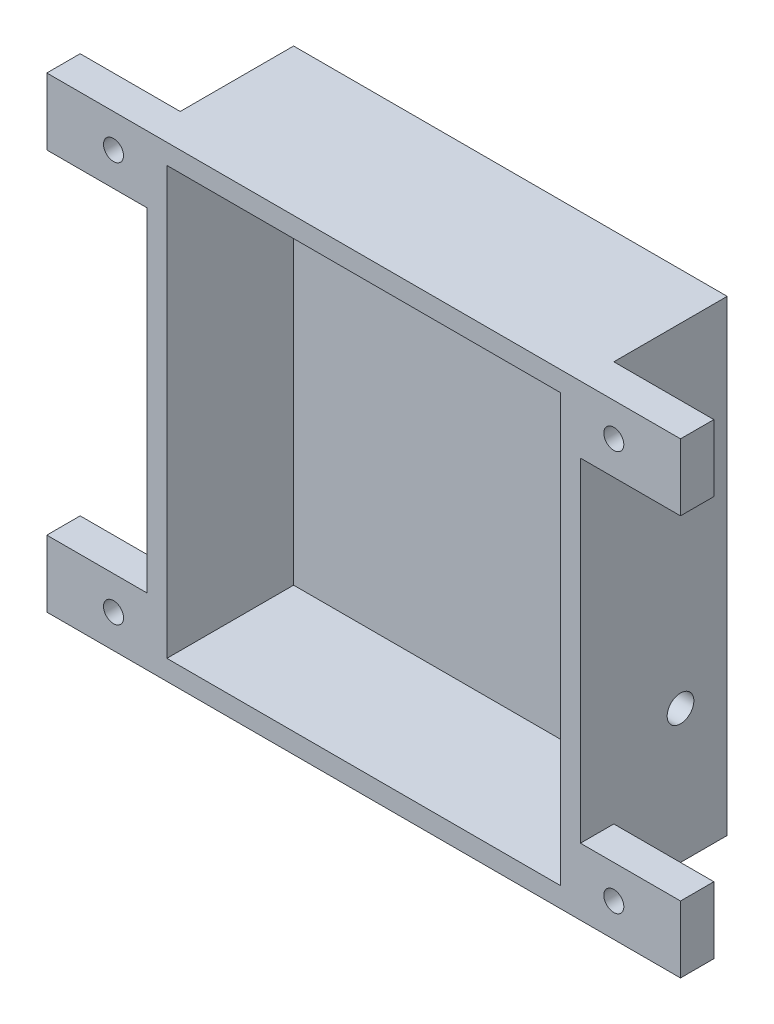
ISO-10303-21;
HEADER;
FILE_DESCRIPTION(('STEP AP214'),'2;1');
FILE_NAME('part.step','',(''),(''),'','','');
FILE_SCHEMA(('AUTOMOTIVE_DESIGN { 1 0 10303 214 1 1 1 1 }'));
ENDSEC;
DATA;
#1=APPLICATION_CONTEXT('core data for automotive mechanical design processes');
#2=APPLICATION_PROTOCOL_DEFINITION('international standard','automotive_design',2000,#1);
#3=PRODUCT_CONTEXT('',#1,'mechanical');
#4=PRODUCT('Part','Part','',(#3));
#5=PRODUCT_RELATED_PRODUCT_CATEGORY('part','',(#4));
#6=PRODUCT_DEFINITION_FORMATION('','',#4);
#7=PRODUCT_DEFINITION_CONTEXT('part definition',#1,'design');
#8=PRODUCT_DEFINITION('design','',#6,#7);
#9=PRODUCT_DEFINITION_SHAPE('','',#8);
#10=(LENGTH_UNIT() NAMED_UNIT(*) SI_UNIT(.MILLI.,.METRE.));
#11=(NAMED_UNIT(*) PLANE_ANGLE_UNIT() SI_UNIT($,.RADIAN.));
#12=(NAMED_UNIT(*) SI_UNIT($,.STERADIAN.) SOLID_ANGLE_UNIT());
#13=UNCERTAINTY_MEASURE_WITH_UNIT(LENGTH_MEASURE(1.E-05),#10,'distance_accuracy_value','');
#14=(GEOMETRIC_REPRESENTATION_CONTEXT(3) GLOBAL_UNCERTAINTY_ASSIGNED_CONTEXT((#13)) GLOBAL_UNIT_ASSIGNED_CONTEXT((#10,
#11,#12)) REPRESENTATION_CONTEXT('',''));
#15=CARTESIAN_POINT('',(0.,0.,0.));
#16=DIRECTION('',(0.,0.,1.));
#17=DIRECTION('',(1.,0.,0.));
#18=AXIS2_PLACEMENT_3D('',#15,#16,#17);
#19=CARTESIAN_POINT('',(-3.,0.,19.));
#20=DIRECTION('',(1.,0.,0.));
#21=DIRECTION('',(0.,0.,-1.));
#22=AXIS2_PLACEMENT_3D('',#19,#20,#21);
#23=PLANE('',#22);
#24=DIRECTION('',(0.,-1.,0.));
#25=VECTOR('',#24,1.);
#26=CARTESIAN_POINT('',(-3.,67.,14.));
#27=LINE('',#26,#25);
#28=CARTESIAN_POINT('',(-3.,67.,14.));
#29=VERTEX_POINT('',#28);
#30=CARTESIAN_POINT('',(-3.,57.,14.));
#31=VERTEX_POINT('',#30);
#32=EDGE_CURVE('E202',#29,#31,#27,.T.);
#33=ORIENTED_EDGE('',*,*,#32,.F.);
#34=DIRECTION('',(0.,0.,-1.));
#35=VECTOR('',#34,1.);
#36=CARTESIAN_POINT('',(-3.,67.,19.));
#37=LINE('',#36,#35);
#38=CARTESIAN_POINT('',(-3.,67.,-3.));
#39=VERTEX_POINT('',#38);
#40=EDGE_CURVE('E185',#29,#39,#37,.T.);
#41=ORIENTED_EDGE('',*,*,#40,.T.);
#42=DIRECTION('',(0.,-1.,0.));
#43=VECTOR('',#42,1.);
#44=CARTESIAN_POINT('',(-3.,0.,-3.));
#45=LINE('',#44,#43);
#46=CARTESIAN_POINT('',(-3.,-3.,-3.));
#47=VERTEX_POINT('',#46);
#48=EDGE_CURVE('E321',#39,#47,#45,.T.);
#49=ORIENTED_EDGE('',*,*,#48,.T.);
#50=DIRECTION('',(0.,0.,-1.));
#51=VECTOR('',#50,1.);
#52=CARTESIAN_POINT('',(-3.,-3.,19.));
#53=LINE('',#52,#51);
#54=CARTESIAN_POINT('',(-3.,-3.,14.));
#55=VERTEX_POINT('',#54);
#56=EDGE_CURVE('E11',#55,#47,#53,.T.);
#57=ORIENTED_EDGE('',*,*,#56,.F.);
#58=DIRECTION('',(0.,-1.,0.));
#59=VECTOR('',#58,1.);
#60=CARTESIAN_POINT('',(-3.,-3.,14.));
#61=LINE('',#60,#59);
#62=CARTESIAN_POINT('',(-3.,7.,14.));
#63=VERTEX_POINT('',#62);
#64=EDGE_CURVE('E222',#63,#55,#61,.T.);
#65=ORIENTED_EDGE('',*,*,#64,.F.);
#66=DIRECTION('',(0.,0.,-1.));
#67=VECTOR('',#66,1.);
#68=CARTESIAN_POINT('',(-3.,7.,19.));
#69=LINE('',#68,#67);
#70=CARTESIAN_POINT('',(-3.,7.,19.));
#71=VERTEX_POINT('',#70);
#72=EDGE_CURVE('E217',#71,#63,#69,.T.);
#73=ORIENTED_EDGE('',*,*,#72,.F.);
#74=DIRECTION('',(0.,-1.,0.));
#75=VECTOR('',#74,1.);
#76=CARTESIAN_POINT('',(-3.,0.,19.));
#77=LINE('',#76,#75);
#78=CARTESIAN_POINT('',(-3.,57.,19.));
#79=VERTEX_POINT('',#78);
#80=EDGE_CURVE('E57',#79,#71,#77,.T.);
#81=ORIENTED_EDGE('',*,*,#80,.F.);
#82=DIRECTION('',(0.,0.,1.));
#83=VECTOR('',#82,1.);
#84=CARTESIAN_POINT('',(-3.,57.,19.));
#85=LINE('',#84,#83);
#86=EDGE_CURVE('E52',#31,#79,#85,.T.);
#87=ORIENTED_EDGE('',*,*,#86,.F.);
#88=EDGE_LOOP('',(#33,#41,#49,#57,#65,#73,#81,#87));
#89=FACE_BOUND('',#88,.T.);
#90=ADVANCED_FACE('F35',(#89),#23,.F.);
#91=CARTESIAN_POINT('',(62.,0.,19.));
#92=DIRECTION('',(-1.,0.,0.));
#93=DIRECTION('',(0.,0.,1.));
#94=AXIS2_PLACEMENT_3D('',#91,#92,#93);
#95=PLANE('',#94);
#96=CARTESIAN_POINT('',(62.,17.,4.));
#97=DIRECTION('',(1.,0.,0.));
#98=DIRECTION('',(0.,0.,-1.));
#99=AXIS2_PLACEMENT_3D('',#96,#97,#98);
#100=CIRCLE('',#99,2.);
#101=CARTESIAN_POINT('',(62.,17.,2.));
#102=VERTEX_POINT('',#101);
#103=EDGE_CURVE('E288',#102,#102,#100,.T.);
#104=ORIENTED_EDGE('',*,*,#103,.F.);
#105=EDGE_LOOP('',(#104));
#106=FACE_BOUND('',#105,.T.);
#107=DIRECTION('',(0.,1.,0.));
#108=VECTOR('',#107,1.);
#109=CARTESIAN_POINT('',(62.,-3.,14.));
#110=LINE('',#109,#108);
#111=CARTESIAN_POINT('',(62.,-3.,14.));
#112=VERTEX_POINT('',#111);
#113=CARTESIAN_POINT('',(62.,7.,14.));
#114=VERTEX_POINT('',#113);
#115=EDGE_CURVE('E242',#112,#114,#110,.T.);
#116=ORIENTED_EDGE('',*,*,#115,.F.);
#117=DIRECTION('',(0.,0.,-1.));
#118=VECTOR('',#117,1.);
#119=CARTESIAN_POINT('',(62.,-3.,19.));
#120=LINE('',#119,#118);
#121=CARTESIAN_POINT('',(62.,-3.,-3.));
#122=VERTEX_POINT('',#121);
#123=EDGE_CURVE('E44',#112,#122,#120,.T.);
#124=ORIENTED_EDGE('',*,*,#123,.T.);
#125=DIRECTION('',(0.,1.,0.));
#126=VECTOR('',#125,1.);
#127=CARTESIAN_POINT('',(62.,0.,-3.));
#128=LINE('',#127,#126);
#129=CARTESIAN_POINT('',(62.,67.,-3.));
#130=VERTEX_POINT('',#129);
#131=EDGE_CURVE('E329',#122,#130,#128,.T.);
#132=ORIENTED_EDGE('',*,*,#131,.T.);
#133=DIRECTION('',(0.,0.,-1.));
#134=VECTOR('',#133,1.);
#135=CARTESIAN_POINT('',(62.,67.,19.));
#136=LINE('',#135,#134);
#137=CARTESIAN_POINT('',(62.,67.,14.));
#138=VERTEX_POINT('',#137);
#139=EDGE_CURVE('E326',#138,#130,#136,.T.);
#140=ORIENTED_EDGE('',*,*,#139,.F.);
#141=DIRECTION('',(0.,1.,0.));
#142=VECTOR('',#141,1.);
#143=CARTESIAN_POINT('',(62.,67.,14.));
#144=LINE('',#143,#142);
#145=CARTESIAN_POINT('',(62.,57.,14.));
#146=VERTEX_POINT('',#145);
#147=EDGE_CURVE('E269',#146,#138,#144,.T.);
#148=ORIENTED_EDGE('',*,*,#147,.F.);
#149=DIRECTION('',(0.,0.,-1.));
#150=VECTOR('',#149,1.);
#151=CARTESIAN_POINT('',(62.,57.,19.));
#152=LINE('',#151,#150);
#153=CARTESIAN_POINT('',(62.,57.,19.));
#154=VERTEX_POINT('',#153);
#155=EDGE_CURVE('E266',#154,#146,#152,.T.);
#156=ORIENTED_EDGE('',*,*,#155,.F.);
#157=DIRECTION('',(0.,1.,0.));
#158=VECTOR('',#157,1.);
#159=CARTESIAN_POINT('',(62.,0.,19.));
#160=LINE('',#159,#158);
#161=CARTESIAN_POINT('',(62.,7.,19.));
#162=VERTEX_POINT('',#161);
#163=EDGE_CURVE('E186',#162,#154,#160,.T.);
#164=ORIENTED_EDGE('',*,*,#163,.F.);
#165=DIRECTION('',(0.,0.,1.));
#166=VECTOR('',#165,1.);
#167=CARTESIAN_POINT('',(62.,7.,19.));
#168=LINE('',#167,#166);
#169=EDGE_CURVE('E247',#114,#162,#168,.T.);
#170=ORIENTED_EDGE('',*,*,#169,.F.);
#171=EDGE_LOOP('',(#116,#124,#132,#140,#148,#156,#164,#170));
#172=FACE_BOUND('',#171,.T.);
#173=ADVANCED_FACE('F344',(#106,#172),#95,.F.);
#174=CARTESIAN_POINT('',(0.,0.,19.));
#175=DIRECTION('',(0.,0.,-1.));
#176=DIRECTION('',(-1.,0.,0.));
#177=AXIS2_PLACEMENT_3D('',#174,#175,#176);
#178=PLANE('',#177);
#179=CARTESIAN_POINT('',(-8.00000000000001,62.,19.));
#180=DIRECTION('',(0.,0.,-1.));
#181=DIRECTION('',(-1.,0.,0.));
#182=AXIS2_PLACEMENT_3D('',#179,#180,#181);
#183=CIRCLE('',#182,1.5);
#184=CARTESIAN_POINT('',(-9.50000000000001,62.,19.));
#185=VERTEX_POINT('',#184);
#186=EDGE_CURVE('E470',#185,#185,#183,.T.);
#187=ORIENTED_EDGE('',*,*,#186,.T.);
#188=EDGE_LOOP('',(#187));
#189=FACE_BOUND('',#188,.T.);
#190=CARTESIAN_POINT('',(67.,2.,19.));
#191=DIRECTION('',(0.,0.,-1.));
#192=DIRECTION('',(-1.,0.,0.));
#193=AXIS2_PLACEMENT_3D('',#190,#191,#192);
#194=CIRCLE('',#193,1.5);
#195=CARTESIAN_POINT('',(65.5,2.,19.));
#196=VERTEX_POINT('',#195);
#197=EDGE_CURVE('E469',#196,#196,#194,.T.);
#198=ORIENTED_EDGE('',*,*,#197,.T.);
#199=EDGE_LOOP('',(#198));
#200=FACE_BOUND('',#199,.T.);
#201=CARTESIAN_POINT('',(-8.,2.,19.));
#202=DIRECTION('',(0.,0.,-1.));
#203=DIRECTION('',(-1.,0.,0.));
#204=AXIS2_PLACEMENT_3D('',#201,#202,#203);
#205=CIRCLE('',#204,1.5);
#206=CARTESIAN_POINT('',(-9.5,2.,19.));
#207=VERTEX_POINT('',#206);
#208=EDGE_CURVE('E467',#207,#207,#205,.T.);
#209=ORIENTED_EDGE('',*,*,#208,.T.);
#210=EDGE_LOOP('',(#209));
#211=FACE_BOUND('',#210,.T.);
#212=CARTESIAN_POINT('',(67.,62.,19.));
#213=DIRECTION('',(0.,0.,-1.));
#214=DIRECTION('',(-1.,0.,0.));
#215=AXIS2_PLACEMENT_3D('',#212,#213,#214);
#216=CIRCLE('',#215,1.5);
#217=CARTESIAN_POINT('',(65.5,62.,19.));
#218=VERTEX_POINT('',#217);
#219=EDGE_CURVE('E205',#218,#218,#216,.T.);
#220=ORIENTED_EDGE('',*,*,#219,.T.);
#221=EDGE_LOOP('',(#220));
#222=FACE_BOUND('',#221,.T.);
#223=DIRECTION('',(-1.,0.,0.));
#224=VECTOR('',#223,1.);
#225=CARTESIAN_POINT('',(0.,67.,19.));
#226=LINE('',#225,#224);
#227=CARTESIAN_POINT('',(77.,67.,19.));
#228=VERTEX_POINT('',#227);
#229=CARTESIAN_POINT('',(-18.,67.,19.));
#230=VERTEX_POINT('',#229);
#231=EDGE_CURVE('E172',#228,#230,#226,.T.);
#232=ORIENTED_EDGE('',*,*,#231,.T.);
#233=DIRECTION('',(0.,1.,0.));
#234=VECTOR('',#233,1.);
#235=CARTESIAN_POINT('',(-18.,67.,19.));
#236=LINE('',#235,#234);
#237=CARTESIAN_POINT('',(-18.,57.,19.));
#238=VERTEX_POINT('',#237);
#239=EDGE_CURVE('E178',#238,#230,#236,.T.);
#240=ORIENTED_EDGE('',*,*,#239,.F.);
#241=DIRECTION('',(1.,0.,0.));
#242=VECTOR('',#241,1.);
#243=CARTESIAN_POINT('',(-18.,57.,19.));
#244=LINE('',#243,#242);
#245=EDGE_CURVE('E210',#238,#79,#244,.T.);
#246=ORIENTED_EDGE('',*,*,#245,.T.);
#247=ORIENTED_EDGE('',*,*,#80,.T.);
#248=DIRECTION('',(1.,0.,0.));
#249=VECTOR('',#248,1.);
#250=CARTESIAN_POINT('',(-18.,7.,19.));
#251=LINE('',#250,#249);
#252=CARTESIAN_POINT('',(-18.,7.,19.));
#253=VERTEX_POINT('',#252);
#254=EDGE_CURVE('E239',#253,#71,#251,.T.);
#255=ORIENTED_EDGE('',*,*,#254,.F.);
#256=DIRECTION('',(0.,1.,0.));
#257=VECTOR('',#256,1.);
#258=CARTESIAN_POINT('',(-18.,-3.,19.));
#259=LINE('',#258,#257);
#260=CARTESIAN_POINT('',(-18.,-3.,19.));
#261=VERTEX_POINT('',#260);
#262=EDGE_CURVE('E218',#261,#253,#259,.T.);
#263=ORIENTED_EDGE('',*,*,#262,.F.);
#264=DIRECTION('',(1.,0.,0.));
#265=VECTOR('',#264,1.);
#266=CARTESIAN_POINT('',(0.,-3.,19.));
#267=LINE('',#266,#265);
#268=CARTESIAN_POINT('',(77.,-3.,19.));
#269=VERTEX_POINT('',#268);
#270=EDGE_CURVE('E337',#261,#269,#267,.T.);
#271=ORIENTED_EDGE('',*,*,#270,.T.);
#272=DIRECTION('',(0.,-1.,0.));
#273=VECTOR('',#272,1.);
#274=CARTESIAN_POINT('',(77.,-3.,19.));
#275=LINE('',#274,#273);
#276=CARTESIAN_POINT('',(77.,7.,19.));
#277=VERTEX_POINT('',#276);
#278=EDGE_CURVE('E243',#277,#269,#275,.T.);
#279=ORIENTED_EDGE('',*,*,#278,.F.);
#280=DIRECTION('',(-1.,0.,0.));
#281=VECTOR('',#280,1.);
#282=CARTESIAN_POINT('',(77.,7.,19.));
#283=LINE('',#282,#281);
#284=EDGE_CURVE('E253',#277,#162,#283,.T.);
#285=ORIENTED_EDGE('',*,*,#284,.T.);
#286=ORIENTED_EDGE('',*,*,#163,.T.);
#287=DIRECTION('',(-1.,0.,0.));
#288=VECTOR('',#287,1.);
#289=CARTESIAN_POINT('',(77.,57.,19.));
#290=LINE('',#289,#288);
#291=CARTESIAN_POINT('',(77.,57.,19.));
#292=VERTEX_POINT('',#291);
#293=EDGE_CURVE('E285',#292,#154,#290,.T.);
#294=ORIENTED_EDGE('',*,*,#293,.F.);
#295=DIRECTION('',(0.,-1.,0.));
#296=VECTOR('',#295,1.);
#297=CARTESIAN_POINT('',(77.,67.,19.));
#298=LINE('',#297,#296);
#299=EDGE_CURVE('E181',#228,#292,#298,.T.);
#300=ORIENTED_EDGE('',*,*,#299,.F.);
#301=EDGE_LOOP('',(#232,#240,#246,#247,#255,#263,#271,#279,#285,#286,#294,#300));
#302=FACE_BOUND('',#301,.T.);
#303=DIRECTION('',(0.,-1.,0.));
#304=VECTOR('',#303,1.);
#305=CARTESIAN_POINT('',(0.,0.,19.));
#306=LINE('',#305,#304);
#307=CARTESIAN_POINT('',(0.,64.,19.));
#308=VERTEX_POINT('',#307);
#309=CARTESIAN_POINT('',(0.,0.,19.));
#310=VERTEX_POINT('',#309);
#311=EDGE_CURVE('E291',#308,#310,#306,.T.);
#312=ORIENTED_EDGE('',*,*,#311,.F.);
#313=DIRECTION('',(-1.,0.,0.));
#314=VECTOR('',#313,1.);
#315=CARTESIAN_POINT('',(0.,64.,19.));
#316=LINE('',#315,#314);
#317=CARTESIAN_POINT('',(59.,64.,19.));
#318=VERTEX_POINT('',#317);
#319=EDGE_CURVE('E299',#318,#308,#316,.T.);
#320=ORIENTED_EDGE('',*,*,#319,.F.);
#321=DIRECTION('',(0.,1.,0.));
#322=VECTOR('',#321,1.);
#323=CARTESIAN_POINT('',(59.,0.,19.));
#324=LINE('',#323,#322);
#325=CARTESIAN_POINT('',(59.,0.,19.));
#326=VERTEX_POINT('',#325);
#327=EDGE_CURVE('E296',#326,#318,#324,.T.);
#328=ORIENTED_EDGE('',*,*,#327,.F.);
#329=DIRECTION('',(1.,0.,0.));
#330=VECTOR('',#329,1.);
#331=CARTESIAN_POINT('',(0.,0.,19.));
#332=LINE('',#331,#330);
#333=EDGE_CURVE('E293',#310,#326,#332,.T.);
#334=ORIENTED_EDGE('',*,*,#333,.F.);
#335=EDGE_LOOP('',(#312,#320,#328,#334));
#336=FACE_BOUND('',#335,.T.);
#337=ADVANCED_FACE('F174',(#189,#200,#211,#222,#302,#336),#178,.F.);
#338=CARTESIAN_POINT('',(0.,-3.,19.));
#339=DIRECTION('',(0.,1.,0.));
#340=DIRECTION('',(0.,0.,1.));
#341=AXIS2_PLACEMENT_3D('',#338,#339,#340);
#342=PLANE('',#341);
#343=DIRECTION('',(1.,0.,0.));
#344=VECTOR('',#343,1.);
#345=CARTESIAN_POINT('',(0.,-3.,-3.));
#346=LINE('',#345,#344);
#347=EDGE_CURVE('E323',#47,#122,#346,.T.);
#348=ORIENTED_EDGE('',*,*,#347,.T.);
#349=ORIENTED_EDGE('',*,*,#123,.F.);
#350=DIRECTION('',(-1.,0.,0.));
#351=VECTOR('',#350,1.);
#352=CARTESIAN_POINT('',(77.,-3.,14.));
#353=LINE('',#352,#351);
#354=CARTESIAN_POINT('',(77.,-3.,14.));
#355=VERTEX_POINT('',#354);
#356=EDGE_CURVE('E263',#355,#112,#353,.T.);
#357=ORIENTED_EDGE('',*,*,#356,.F.);
#358=DIRECTION('',(0.,0.,-1.));
#359=VECTOR('',#358,1.);
#360=CARTESIAN_POINT('',(77.,-3.,19.));
#361=LINE('',#360,#359);
#362=EDGE_CURVE('E246',#269,#355,#361,.T.);
#363=ORIENTED_EDGE('',*,*,#362,.F.);
#364=ORIENTED_EDGE('',*,*,#270,.F.);
#365=DIRECTION('',(0.,0.,1.));
#366=VECTOR('',#365,1.);
#367=CARTESIAN_POINT('',(-18.,-3.,19.));
#368=LINE('',#367,#366);
#369=CARTESIAN_POINT('',(-18.,-3.,14.));
#370=VERTEX_POINT('',#369);
#371=EDGE_CURVE('E226',#370,#261,#368,.T.);
#372=ORIENTED_EDGE('',*,*,#371,.F.);
#373=DIRECTION('',(1.,0.,0.));
#374=VECTOR('',#373,1.);
#375=CARTESIAN_POINT('',(-18.,-3.,14.));
#376=LINE('',#375,#374);
#377=EDGE_CURVE('E229',#370,#55,#376,.T.);
#378=ORIENTED_EDGE('',*,*,#377,.T.);
#379=ORIENTED_EDGE('',*,*,#56,.T.);
#380=EDGE_LOOP('',(#348,#349,#357,#363,#364,#372,#378,#379));
#381=FACE_BOUND('',#380,.T.);
#382=ADVANCED_FACE('F376',(#381),#342,.F.);
#383=CARTESIAN_POINT('',(0.,67.,19.));
#384=DIRECTION('',(0.,-1.,0.));
#385=DIRECTION('',(0.,0.,-1.));
#386=AXIS2_PLACEMENT_3D('',#383,#384,#385);
#387=PLANE('',#386);
#388=DIRECTION('',(-1.,0.,0.));
#389=VECTOR('',#388,1.);
#390=CARTESIAN_POINT('',(0.,67.,-3.));
#391=LINE('',#390,#389);
#392=EDGE_CURVE('E333',#130,#39,#391,.T.);
#393=ORIENTED_EDGE('',*,*,#392,.T.);
#394=ORIENTED_EDGE('',*,*,#40,.F.);
#395=DIRECTION('',(1.,0.,0.));
#396=VECTOR('',#395,1.);
#397=CARTESIAN_POINT('',(-18.,67.,14.));
#398=LINE('',#397,#396);
#399=CARTESIAN_POINT('',(-18.,67.,14.));
#400=VERTEX_POINT('',#399);
#401=EDGE_CURVE('E192',#400,#29,#398,.T.);
#402=ORIENTED_EDGE('',*,*,#401,.F.);
#403=DIRECTION('',(0.,0.,-1.));
#404=VECTOR('',#403,1.);
#405=CARTESIAN_POINT('',(-18.,67.,19.));
#406=LINE('',#405,#404);
#407=EDGE_CURVE('E188',#230,#400,#406,.T.);
#408=ORIENTED_EDGE('',*,*,#407,.F.);
#409=ORIENTED_EDGE('',*,*,#231,.F.);
#410=DIRECTION('',(0.,0.,1.));
#411=VECTOR('',#410,1.);
#412=CARTESIAN_POINT('',(77.,67.,19.));
#413=LINE('',#412,#411);
#414=CARTESIAN_POINT('',(77.,67.,14.));
#415=VERTEX_POINT('',#414);
#416=EDGE_CURVE('E273',#415,#228,#413,.T.);
#417=ORIENTED_EDGE('',*,*,#416,.F.);
#418=DIRECTION('',(-1.,0.,0.));
#419=VECTOR('',#418,1.);
#420=CARTESIAN_POINT('',(77.,67.,14.));
#421=LINE('',#420,#419);
#422=EDGE_CURVE('E275',#415,#138,#421,.T.);
#423=ORIENTED_EDGE('',*,*,#422,.T.);
#424=ORIENTED_EDGE('',*,*,#139,.T.);
#425=EDGE_LOOP('',(#393,#394,#402,#408,#409,#417,#423,#424));
#426=FACE_BOUND('',#425,.T.);
#427=ADVANCED_FACE('F190',(#426),#387,.F.);
#428=CARTESIAN_POINT('',(0.,0.,-3.));
#429=DIRECTION('',(0.,0.,-1.));
#430=DIRECTION('',(-1.,0.,0.));
#431=AXIS2_PLACEMENT_3D('',#428,#429,#430);
#432=PLANE('',#431);
#433=ORIENTED_EDGE('',*,*,#48,.F.);
#434=ORIENTED_EDGE('',*,*,#392,.F.);
#435=ORIENTED_EDGE('',*,*,#131,.F.);
#436=ORIENTED_EDGE('',*,*,#347,.F.);
#437=EDGE_LOOP('',(#433,#434,#435,#436));
#438=FACE_BOUND('',#437,.T.);
#439=ADVANCED_FACE('F37',(#438),#432,.T.);
#440=CARTESIAN_POINT('',(0.,0.,19.));
#441=DIRECTION('',(1.,0.,0.));
#442=DIRECTION('',(0.,0.,-1.));
#443=AXIS2_PLACEMENT_3D('',#440,#441,#442);
#444=PLANE('',#443);
#445=DIRECTION('',(0.,-1.,0.));
#446=VECTOR('',#445,1.);
#447=CARTESIAN_POINT('',(0.,0.,0.));
#448=LINE('',#447,#446);
#449=CARTESIAN_POINT('',(0.,64.,0.));
#450=VERTEX_POINT('',#449);
#451=CARTESIAN_POINT('',(0.,0.,0.));
#452=VERTEX_POINT('',#451);
#453=EDGE_CURVE('E302',#450,#452,#448,.T.);
#454=ORIENTED_EDGE('',*,*,#453,.F.);
#455=DIRECTION('',(0.,0.,-1.));
#456=VECTOR('',#455,1.);
#457=CARTESIAN_POINT('',(0.,64.,19.));
#458=LINE('',#457,#456);
#459=EDGE_CURVE('E301',#308,#450,#458,.T.);
#460=ORIENTED_EDGE('',*,*,#459,.F.);
#461=ORIENTED_EDGE('',*,*,#311,.T.);
#462=DIRECTION('',(0.,0.,-1.));
#463=VECTOR('',#462,1.);
#464=CARTESIAN_POINT('',(0.,0.,19.));
#465=LINE('',#464,#463);
#466=EDGE_CURVE('E318',#310,#452,#465,.T.);
#467=ORIENTED_EDGE('',*,*,#466,.T.);
#468=EDGE_LOOP('',(#454,#460,#461,#467));
#469=FACE_BOUND('',#468,.T.);
#470=ADVANCED_FACE('F383',(#469),#444,.T.);
#471=CARTESIAN_POINT('',(0.,0.,19.));
#472=DIRECTION('',(0.,1.,0.));
#473=DIRECTION('',(0.,0.,1.));
#474=AXIS2_PLACEMENT_3D('',#471,#472,#473);
#475=PLANE('',#474);
#476=DIRECTION('',(1.,0.,0.));
#477=VECTOR('',#476,1.);
#478=CARTESIAN_POINT('',(0.,0.,0.));
#479=LINE('',#478,#477);
#480=CARTESIAN_POINT('',(59.,0.,0.));
#481=VERTEX_POINT('',#480);
#482=EDGE_CURVE('E305',#452,#481,#479,.T.);
#483=ORIENTED_EDGE('',*,*,#482,.F.);
#484=ORIENTED_EDGE('',*,*,#466,.F.);
#485=ORIENTED_EDGE('',*,*,#333,.T.);
#486=DIRECTION('',(0.,0.,-1.));
#487=VECTOR('',#486,1.);
#488=CARTESIAN_POINT('',(59.,0.,19.));
#489=LINE('',#488,#487);
#490=EDGE_CURVE('E315',#326,#481,#489,.T.);
#491=ORIENTED_EDGE('',*,*,#490,.T.);
#492=EDGE_LOOP('',(#483,#484,#485,#491));
#493=FACE_BOUND('',#492,.T.);
#494=ADVANCED_FACE('F388',(#493),#475,.T.);
#495=CARTESIAN_POINT('',(59.,0.,19.));
#496=DIRECTION('',(-1.,0.,0.));
#497=DIRECTION('',(0.,0.,1.));
#498=AXIS2_PLACEMENT_3D('',#495,#496,#497);
#499=PLANE('',#498);
#500=CARTESIAN_POINT('',(59.,17.,4.));
#501=DIRECTION('',(-1.,0.,0.));
#502=DIRECTION('',(0.,0.,1.));
#503=AXIS2_PLACEMENT_3D('',#500,#501,#502);
#504=CIRCLE('',#503,2.);
#505=CARTESIAN_POINT('',(59.,17.,6.));
#506=VERTEX_POINT('',#505);
#507=EDGE_CURVE('E39',#506,#506,#504,.T.);
#508=ORIENTED_EDGE('',*,*,#507,.F.);
#509=EDGE_LOOP('',(#508));
#510=FACE_BOUND('',#509,.T.);
#511=DIRECTION('',(0.,1.,0.));
#512=VECTOR('',#511,1.);
#513=CARTESIAN_POINT('',(59.,0.,0.));
#514=LINE('',#513,#512);
#515=CARTESIAN_POINT('',(59.,64.,0.));
#516=VERTEX_POINT('',#515);
#517=EDGE_CURVE('E307',#481,#516,#514,.T.);
#518=ORIENTED_EDGE('',*,*,#517,.F.);
#519=ORIENTED_EDGE('',*,*,#490,.F.);
#520=ORIENTED_EDGE('',*,*,#327,.T.);
#521=DIRECTION('',(0.,0.,-1.));
#522=VECTOR('',#521,1.);
#523=CARTESIAN_POINT('',(59.,64.,19.));
#524=LINE('',#523,#522);
#525=EDGE_CURVE('E312',#318,#516,#524,.T.);
#526=ORIENTED_EDGE('',*,*,#525,.T.);
#527=EDGE_LOOP('',(#518,#519,#520,#526));
#528=FACE_BOUND('',#527,.T.);
#529=ADVANCED_FACE('F651',(#510,#528),#499,.T.);
#530=CARTESIAN_POINT('',(0.,64.,19.));
#531=DIRECTION('',(0.,-1.,0.));
#532=DIRECTION('',(0.,0.,-1.));
#533=AXIS2_PLACEMENT_3D('',#530,#531,#532);
#534=PLANE('',#533);
#535=DIRECTION('',(-1.,0.,0.));
#536=VECTOR('',#535,1.);
#537=CARTESIAN_POINT('',(0.,64.,0.));
#538=LINE('',#537,#536);
#539=EDGE_CURVE('E294',#516,#450,#538,.T.);
#540=ORIENTED_EDGE('',*,*,#539,.F.);
#541=ORIENTED_EDGE('',*,*,#525,.F.);
#542=ORIENTED_EDGE('',*,*,#319,.T.);
#543=ORIENTED_EDGE('',*,*,#459,.T.);
#544=EDGE_LOOP('',(#540,#541,#542,#543));
#545=FACE_BOUND('',#544,.T.);
#546=ADVANCED_FACE('F656',(#545),#534,.T.);
#547=CARTESIAN_POINT('',(0.,0.,0.));
#548=DIRECTION('',(0.,0.,-1.));
#549=DIRECTION('',(-1.,0.,0.));
#550=AXIS2_PLACEMENT_3D('',#547,#548,#549);
#551=PLANE('',#550);
#552=ORIENTED_EDGE('',*,*,#453,.T.);
#553=ORIENTED_EDGE('',*,*,#482,.T.);
#554=ORIENTED_EDGE('',*,*,#517,.T.);
#555=ORIENTED_EDGE('',*,*,#539,.T.);
#556=EDGE_LOOP('',(#552,#553,#554,#555));
#557=FACE_BOUND('',#556,.T.);
#558=ADVANCED_FACE('F641',(#557),#551,.F.);
#559=CARTESIAN_POINT('',(43.,17.,4.));
#560=DIRECTION('',(1.,0.,0.));
#561=DIRECTION('',(0.,0.,-1.));
#562=AXIS2_PLACEMENT_3D('',#559,#560,#561);
#563=CYLINDRICAL_SURFACE('',#562,2.);
#564=ORIENTED_EDGE('',*,*,#507,.T.);
#565=EDGE_LOOP('',(#564));
#566=FACE_BOUND('',#565,.T.);
#567=ORIENTED_EDGE('',*,*,#103,.T.);
#568=EDGE_LOOP('',(#567));
#569=FACE_BOUND('',#568,.T.);
#570=ADVANCED_FACE('F363',(#566,#569),#563,.F.);
#571=CARTESIAN_POINT('',(77.,57.,19.));
#572=DIRECTION('',(0.,1.,0.));
#573=DIRECTION('',(0.,0.,1.));
#574=AXIS2_PLACEMENT_3D('',#571,#572,#573);
#575=PLANE('',#574);
#576=ORIENTED_EDGE('',*,*,#155,.T.);
#577=DIRECTION('',(-1.,0.,0.));
#578=VECTOR('',#577,1.);
#579=CARTESIAN_POINT('',(77.,57.,14.));
#580=LINE('',#579,#578);
#581=CARTESIAN_POINT('',(77.,57.,14.));
#582=VERTEX_POINT('',#581);
#583=EDGE_CURVE('E282',#582,#146,#580,.T.);
#584=ORIENTED_EDGE('',*,*,#583,.F.);
#585=DIRECTION('',(0.,0.,-1.));
#586=VECTOR('',#585,1.);
#587=CARTESIAN_POINT('',(77.,57.,19.));
#588=LINE('',#587,#586);
#589=EDGE_CURVE('E268',#292,#582,#588,.T.);
#590=ORIENTED_EDGE('',*,*,#589,.F.);
#591=ORIENTED_EDGE('',*,*,#293,.T.);
#592=EDGE_LOOP('',(#576,#584,#590,#591));
#593=FACE_BOUND('',#592,.T.);
#594=ADVANCED_FACE('F347',(#593),#575,.F.);
#595=CARTESIAN_POINT('',(77.,67.,14.));
#596=DIRECTION('',(0.,0.,1.));
#597=DIRECTION('',(1.,0.,0.));
#598=AXIS2_PLACEMENT_3D('',#595,#596,#597);
#599=PLANE('',#598);
#600=CARTESIAN_POINT('',(67.,62.,14.));
#601=DIRECTION('',(0.,0.,-1.));
#602=DIRECTION('',(-1.,0.,0.));
#603=AXIS2_PLACEMENT_3D('',#600,#601,#602);
#604=CIRCLE('',#603,1.5);
#605=CARTESIAN_POINT('',(65.5,62.,14.));
#606=VERTEX_POINT('',#605);
#607=EDGE_CURVE('E474',#606,#606,#604,.T.);
#608=ORIENTED_EDGE('',*,*,#607,.F.);
#609=EDGE_LOOP('',(#608));
#610=FACE_BOUND('',#609,.T.);
#611=ORIENTED_EDGE('',*,*,#147,.T.);
#612=ORIENTED_EDGE('',*,*,#422,.F.);
#613=DIRECTION('',(0.,1.,0.));
#614=VECTOR('',#613,1.);
#615=CARTESIAN_POINT('',(77.,67.,14.));
#616=LINE('',#615,#614);
#617=EDGE_CURVE('E271',#582,#415,#616,.T.);
#618=ORIENTED_EDGE('',*,*,#617,.F.);
#619=ORIENTED_EDGE('',*,*,#583,.T.);
#620=EDGE_LOOP('',(#611,#612,#618,#619));
#621=FACE_BOUND('',#620,.T.);
#622=ADVANCED_FACE('F353',(#610,#621),#599,.F.);
#623=CARTESIAN_POINT('',(77.,0.,0.));
#624=DIRECTION('',(1.,0.,0.));
#625=DIRECTION('',(0.,0.,-1.));
#626=AXIS2_PLACEMENT_3D('',#623,#624,#625);
#627=PLANE('',#626);
#628=ORIENTED_EDGE('',*,*,#299,.T.);
#629=ORIENTED_EDGE('',*,*,#589,.T.);
#630=ORIENTED_EDGE('',*,*,#617,.T.);
#631=ORIENTED_EDGE('',*,*,#416,.T.);
#632=EDGE_LOOP('',(#628,#629,#630,#631));
#633=FACE_BOUND('',#632,.T.);
#634=ADVANCED_FACE('F350',(#633),#627,.T.);
#635=CARTESIAN_POINT('',(77.,-3.,14.));
#636=DIRECTION('',(0.,0.,1.));
#637=DIRECTION('',(1.,0.,0.));
#638=AXIS2_PLACEMENT_3D('',#635,#636,#637);
#639=PLANE('',#638);
#640=CARTESIAN_POINT('',(67.,2.,14.));
#641=DIRECTION('',(0.,0.,-1.));
#642=DIRECTION('',(-1.,0.,0.));
#643=AXIS2_PLACEMENT_3D('',#640,#641,#642);
#644=CIRCLE('',#643,1.5);
#645=CARTESIAN_POINT('',(65.5,2.,14.));
#646=VERTEX_POINT('',#645);
#647=EDGE_CURVE('E482',#646,#646,#644,.T.);
#648=ORIENTED_EDGE('',*,*,#647,.F.);
#649=EDGE_LOOP('',(#648));
#650=FACE_BOUND('',#649,.T.);
#651=ORIENTED_EDGE('',*,*,#115,.T.);
#652=DIRECTION('',(-1.,0.,0.));
#653=VECTOR('',#652,1.);
#654=CARTESIAN_POINT('',(77.,7.,14.));
#655=LINE('',#654,#653);
#656=CARTESIAN_POINT('',(77.,7.,14.));
#657=VERTEX_POINT('',#656);
#658=EDGE_CURVE('E260',#657,#114,#655,.T.);
#659=ORIENTED_EDGE('',*,*,#658,.F.);
#660=DIRECTION('',(0.,1.,0.));
#661=VECTOR('',#660,1.);
#662=CARTESIAN_POINT('',(77.,-3.,14.));
#663=LINE('',#662,#661);
#664=EDGE_CURVE('E249',#355,#657,#663,.T.);
#665=ORIENTED_EDGE('',*,*,#664,.F.);
#666=ORIENTED_EDGE('',*,*,#356,.T.);
#667=EDGE_LOOP('',(#651,#659,#665,#666));
#668=FACE_BOUND('',#667,.T.);
#669=ADVANCED_FACE('F361',(#650,#668),#639,.F.);
#670=CARTESIAN_POINT('',(77.,7.,19.));
#671=DIRECTION('',(0.,-1.,0.));
#672=DIRECTION('',(0.,0.,-1.));
#673=AXIS2_PLACEMENT_3D('',#670,#671,#672);
#674=PLANE('',#673);
#675=ORIENTED_EDGE('',*,*,#169,.T.);
#676=ORIENTED_EDGE('',*,*,#284,.F.);
#677=DIRECTION('',(0.,0.,1.));
#678=VECTOR('',#677,1.);
#679=CARTESIAN_POINT('',(77.,7.,19.));
#680=LINE('',#679,#678);
#681=EDGE_CURVE('E251',#657,#277,#680,.T.);
#682=ORIENTED_EDGE('',*,*,#681,.F.);
#683=ORIENTED_EDGE('',*,*,#658,.T.);
#684=EDGE_LOOP('',(#675,#676,#682,#683));
#685=FACE_BOUND('',#684,.T.);
#686=ADVANCED_FACE('F416',(#685),#674,.F.);
#687=CARTESIAN_POINT('',(77.,0.,0.));
#688=DIRECTION('',(-1.,0.,0.));
#689=DIRECTION('',(0.,0.,1.));
#690=AXIS2_PLACEMENT_3D('',#687,#688,#689);
#691=PLANE('',#690);
#692=ORIENTED_EDGE('',*,*,#278,.T.);
#693=ORIENTED_EDGE('',*,*,#362,.T.);
#694=ORIENTED_EDGE('',*,*,#664,.T.);
#695=ORIENTED_EDGE('',*,*,#681,.T.);
#696=EDGE_LOOP('',(#692,#693,#694,#695));
#697=FACE_BOUND('',#696,.T.);
#698=ADVANCED_FACE('F412',(#697),#691,.F.);
#699=CARTESIAN_POINT('',(-18.,7.,19.));
#700=DIRECTION('',(0.,-1.,0.));
#701=DIRECTION('',(0.,0.,-1.));
#702=AXIS2_PLACEMENT_3D('',#699,#700,#701);
#703=PLANE('',#702);
#704=ORIENTED_EDGE('',*,*,#72,.T.);
#705=DIRECTION('',(1.,0.,0.));
#706=VECTOR('',#705,1.);
#707=CARTESIAN_POINT('',(-18.,7.,14.));
#708=LINE('',#707,#706);
#709=CARTESIAN_POINT('',(-18.,7.,14.));
#710=VERTEX_POINT('',#709);
#711=EDGE_CURVE('E236',#710,#63,#708,.T.);
#712=ORIENTED_EDGE('',*,*,#711,.F.);
#713=DIRECTION('',(0.,0.,-1.));
#714=VECTOR('',#713,1.);
#715=CARTESIAN_POINT('',(-18.,7.,19.));
#716=LINE('',#715,#714);
#717=EDGE_CURVE('E221',#253,#710,#716,.T.);
#718=ORIENTED_EDGE('',*,*,#717,.F.);
#719=ORIENTED_EDGE('',*,*,#254,.T.);
#720=EDGE_LOOP('',(#704,#712,#718,#719));
#721=FACE_BOUND('',#720,.T.);
#722=ADVANCED_FACE('F403',(#721),#703,.F.);
#723=CARTESIAN_POINT('',(-18.,-3.,14.));
#724=DIRECTION('',(0.,0.,1.));
#725=DIRECTION('',(1.,0.,0.));
#726=AXIS2_PLACEMENT_3D('',#723,#724,#725);
#727=PLANE('',#726);
#728=CARTESIAN_POINT('',(-8.,2.,14.));
#729=DIRECTION('',(0.,0.,-1.));
#730=DIRECTION('',(-1.,0.,0.));
#731=AXIS2_PLACEMENT_3D('',#728,#729,#730);
#732=CIRCLE('',#731,1.5);
#733=CARTESIAN_POINT('',(-9.5,2.,14.));
#734=VERTEX_POINT('',#733);
#735=EDGE_CURVE('E464',#734,#734,#732,.T.);
#736=ORIENTED_EDGE('',*,*,#735,.F.);
#737=EDGE_LOOP('',(#736));
#738=FACE_BOUND('',#737,.T.);
#739=ORIENTED_EDGE('',*,*,#64,.T.);
#740=ORIENTED_EDGE('',*,*,#377,.F.);
#741=DIRECTION('',(0.,-1.,0.));
#742=VECTOR('',#741,1.);
#743=CARTESIAN_POINT('',(-18.,-3.,14.));
#744=LINE('',#743,#742);
#745=EDGE_CURVE('E224',#710,#370,#744,.T.);
#746=ORIENTED_EDGE('',*,*,#745,.F.);
#747=ORIENTED_EDGE('',*,*,#711,.T.);
#748=EDGE_LOOP('',(#739,#740,#746,#747));
#749=FACE_BOUND('',#748,.T.);
#750=ADVANCED_FACE('F431',(#738,#749),#727,.F.);
#751=CARTESIAN_POINT('',(-18.,0.,0.));
#752=DIRECTION('',(-1.,0.,0.));
#753=DIRECTION('',(0.,0.,1.));
#754=AXIS2_PLACEMENT_3D('',#751,#752,#753);
#755=PLANE('',#754);
#756=ORIENTED_EDGE('',*,*,#262,.T.);
#757=ORIENTED_EDGE('',*,*,#717,.T.);
#758=ORIENTED_EDGE('',*,*,#745,.T.);
#759=ORIENTED_EDGE('',*,*,#371,.T.);
#760=EDGE_LOOP('',(#756,#757,#758,#759));
#761=FACE_BOUND('',#760,.T.);
#762=ADVANCED_FACE('F406',(#761),#755,.T.);
#763=CARTESIAN_POINT('',(-18.,67.,14.));
#764=DIRECTION('',(0.,0.,1.));
#765=DIRECTION('',(1.,0.,0.));
#766=AXIS2_PLACEMENT_3D('',#763,#764,#765);
#767=PLANE('',#766);
#768=CARTESIAN_POINT('',(-8.00000000000001,62.,14.));
#769=DIRECTION('',(0.,0.,-1.));
#770=DIRECTION('',(-1.,0.,0.));
#771=AXIS2_PLACEMENT_3D('',#768,#769,#770);
#772=CIRCLE('',#771,1.5);
#773=CARTESIAN_POINT('',(-9.50000000000001,62.,14.));
#774=VERTEX_POINT('',#773);
#775=EDGE_CURVE('E479',#774,#774,#772,.T.);
#776=ORIENTED_EDGE('',*,*,#775,.F.);
#777=EDGE_LOOP('',(#776));
#778=FACE_BOUND('',#777,.T.);
#779=ORIENTED_EDGE('',*,*,#32,.T.);
#780=DIRECTION('',(1.,0.,0.));
#781=VECTOR('',#780,1.);
#782=CARTESIAN_POINT('',(-18.,57.,14.));
#783=LINE('',#782,#781);
#784=CARTESIAN_POINT('',(-18.,57.,14.));
#785=VERTEX_POINT('',#784);
#786=EDGE_CURVE('E213',#785,#31,#783,.T.);
#787=ORIENTED_EDGE('',*,*,#786,.F.);
#788=DIRECTION('',(0.,-1.,0.));
#789=VECTOR('',#788,1.);
#790=CARTESIAN_POINT('',(-18.,67.,14.));
#791=LINE('',#790,#789);
#792=EDGE_CURVE('E195',#400,#785,#791,.T.);
#793=ORIENTED_EDGE('',*,*,#792,.F.);
#794=ORIENTED_EDGE('',*,*,#401,.T.);
#795=EDGE_LOOP('',(#779,#787,#793,#794));
#796=FACE_BOUND('',#795,.T.);
#797=ADVANCED_FACE('F396',(#778,#796),#767,.F.);
#798=CARTESIAN_POINT('',(-18.,57.,19.));
#799=DIRECTION('',(0.,1.,0.));
#800=DIRECTION('',(0.,0.,1.));
#801=AXIS2_PLACEMENT_3D('',#798,#799,#800);
#802=PLANE('',#801);
#803=ORIENTED_EDGE('',*,*,#86,.T.);
#804=ORIENTED_EDGE('',*,*,#245,.F.);
#805=DIRECTION('',(0.,0.,1.));
#806=VECTOR('',#805,1.);
#807=CARTESIAN_POINT('',(-18.,57.,19.));
#808=LINE('',#807,#806);
#809=EDGE_CURVE('E199',#785,#238,#808,.T.);
#810=ORIENTED_EDGE('',*,*,#809,.F.);
#811=ORIENTED_EDGE('',*,*,#786,.T.);
#812=EDGE_LOOP('',(#803,#804,#810,#811));
#813=FACE_BOUND('',#812,.T.);
#814=ADVANCED_FACE('F398',(#813),#802,.F.);
#815=CARTESIAN_POINT('',(-18.,0.,0.));
#816=DIRECTION('',(1.,0.,0.));
#817=DIRECTION('',(0.,0.,-1.));
#818=AXIS2_PLACEMENT_3D('',#815,#816,#817);
#819=PLANE('',#818);
#820=ORIENTED_EDGE('',*,*,#239,.T.);
#821=ORIENTED_EDGE('',*,*,#407,.T.);
#822=ORIENTED_EDGE('',*,*,#792,.T.);
#823=ORIENTED_EDGE('',*,*,#809,.T.);
#824=EDGE_LOOP('',(#820,#821,#822,#823));
#825=FACE_BOUND('',#824,.T.);
#826=ADVANCED_FACE('F197',(#825),#819,.F.);
#827=CARTESIAN_POINT('',(-8.00000000000001,62.,24.));
#828=DIRECTION('',(0.,0.,-1.));
#829=DIRECTION('',(-1.,0.,0.));
#830=AXIS2_PLACEMENT_3D('',#827,#828,#829);
#831=CYLINDRICAL_SURFACE('',#830,1.5);
#832=ORIENTED_EDGE('',*,*,#775,.T.);
#833=EDGE_LOOP('',(#832));
#834=FACE_BOUND('',#833,.T.);
#835=ORIENTED_EDGE('',*,*,#186,.F.);
#836=EDGE_LOOP('',(#835));
#837=FACE_BOUND('',#836,.T.);
#838=ADVANCED_FACE('F444',(#834,#837),#831,.F.);
#839=CARTESIAN_POINT('',(-8.,2.,24.));
#840=DIRECTION('',(0.,0.,-1.));
#841=DIRECTION('',(-1.,0.,0.));
#842=AXIS2_PLACEMENT_3D('',#839,#840,#841);
#843=CYLINDRICAL_SURFACE('',#842,1.5);
#844=ORIENTED_EDGE('',*,*,#735,.T.);
#845=EDGE_LOOP('',(#844));
#846=FACE_BOUND('',#845,.T.);
#847=ORIENTED_EDGE('',*,*,#208,.F.);
#848=EDGE_LOOP('',(#847));
#849=FACE_BOUND('',#848,.T.);
#850=ADVANCED_FACE('F452',(#846,#849),#843,.F.);
#851=CARTESIAN_POINT('',(67.,2.,24.));
#852=DIRECTION('',(0.,0.,-1.));
#853=DIRECTION('',(-1.,0.,0.));
#854=AXIS2_PLACEMENT_3D('',#851,#852,#853);
#855=CYLINDRICAL_SURFACE('',#854,1.5);
#856=ORIENTED_EDGE('',*,*,#647,.T.);
#857=EDGE_LOOP('',(#856));
#858=FACE_BOUND('',#857,.T.);
#859=ORIENTED_EDGE('',*,*,#197,.F.);
#860=EDGE_LOOP('',(#859));
#861=FACE_BOUND('',#860,.T.);
#862=ADVANCED_FACE('F448',(#858,#861),#855,.F.);
#863=CARTESIAN_POINT('',(67.,62.,24.));
#864=DIRECTION('',(0.,0.,-1.));
#865=DIRECTION('',(-1.,0.,0.));
#866=AXIS2_PLACEMENT_3D('',#863,#864,#865);
#867=CYLINDRICAL_SURFACE('',#866,1.5);
#868=ORIENTED_EDGE('',*,*,#607,.T.);
#869=EDGE_LOOP('',(#868));
#870=FACE_BOUND('',#869,.T.);
#871=ORIENTED_EDGE('',*,*,#219,.F.);
#872=EDGE_LOOP('',(#871));
#873=FACE_BOUND('',#872,.T.);
#874=ADVANCED_FACE('F445',(#870,#873),#867,.F.);
#875=CLOSED_SHELL('',(#90,#173,#337,#382,#427,#439,#470,#494,#529,#546,#558,#570,#594,#622,#634,
#669,#686,#698,#722,#750,#762,#797,#814,#826,#838,#850,#862,#874));
#876=MANIFOLD_SOLID_BREP('B2',#875);
#877=ADVANCED_BREP_SHAPE_REPRESENTATION('',(#18,#876),#14);
#878=SHAPE_DEFINITION_REPRESENTATION(#9,#877);
ENDSEC;
END-ISO-10303-21;
